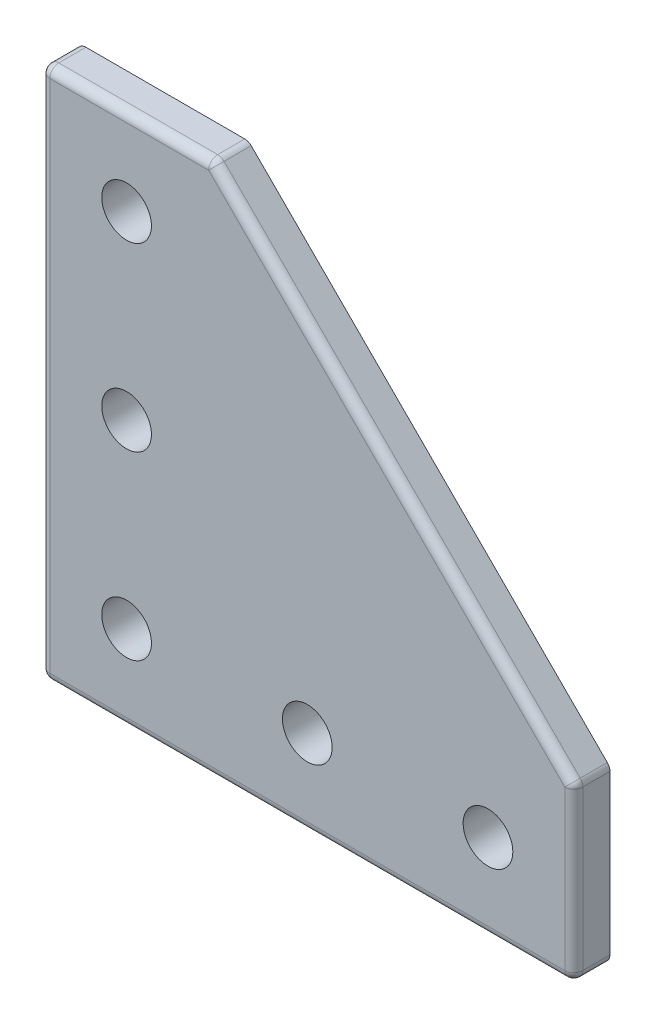
ISO-10303-21;
HEADER;
FILE_DESCRIPTION(('STEP AP214'),'2;1');
FILE_NAME('part.step','',(''),(''),'','','');
FILE_SCHEMA(('AUTOMOTIVE_DESIGN { 1 0 10303 214 1 1 1 1 }'));
ENDSEC;
DATA;
#1=APPLICATION_CONTEXT('core data for automotive mechanical design processes');
#2=APPLICATION_PROTOCOL_DEFINITION('international standard','automotive_design',2000,#1);
#3=PRODUCT_CONTEXT('',#1,'mechanical');
#4=PRODUCT('Part','Part','',(#3));
#5=PRODUCT_RELATED_PRODUCT_CATEGORY('part','',(#4));
#6=PRODUCT_DEFINITION_FORMATION('','',#4);
#7=PRODUCT_DEFINITION_CONTEXT('part definition',#1,'design');
#8=PRODUCT_DEFINITION('design','',#6,#7);
#9=PRODUCT_DEFINITION_SHAPE('','',#8);
#10=(LENGTH_UNIT() NAMED_UNIT(*) SI_UNIT(.MILLI.,.METRE.));
#11=(NAMED_UNIT(*) PLANE_ANGLE_UNIT() SI_UNIT($,.RADIAN.));
#12=(NAMED_UNIT(*) SI_UNIT($,.STERADIAN.) SOLID_ANGLE_UNIT());
#13=UNCERTAINTY_MEASURE_WITH_UNIT(LENGTH_MEASURE(1.E-05),#10,'distance_accuracy_value','');
#14=(GEOMETRIC_REPRESENTATION_CONTEXT(3) GLOBAL_UNCERTAINTY_ASSIGNED_CONTEXT((#13)) GLOBAL_UNIT_ASSIGNED_CONTEXT((#10,
#11,#12)) REPRESENTATION_CONTEXT('',''));
#15=CARTESIAN_POINT('',(0.,0.,0.));
#16=DIRECTION('',(0.,0.,1.));
#17=DIRECTION('',(1.,0.,0.));
#18=AXIS2_PLACEMENT_3D('',#15,#16,#17);
#19=CARTESIAN_POINT('',(0.,0.,2.));
#20=DIRECTION('',(0.,0.,-1.));
#21=DIRECTION('',(-1.,0.,0.));
#22=AXIS2_PLACEMENT_3D('',#19,#20,#21);
#23=PLANE('',#22);
#24=DIRECTION('',(0.,-1.,0.));
#25=VECTOR('',#24,1.);
#26=CARTESIAN_POINT('',(1.,0.,2.));
#27=LINE('',#26,#25);
#28=CARTESIAN_POINT('',(1.,58.,2.));
#29=VERTEX_POINT('',#28);
#30=CARTESIAN_POINT('',(1.,1.,2.));
#31=VERTEX_POINT('',#30);
#32=EDGE_CURVE('E1161',#29,#31,#27,.T.);
#33=ORIENTED_EDGE('',*,*,#32,.T.);
#34=DIRECTION('',(1.,0.,0.));
#35=VECTOR('',#34,1.);
#36=CARTESIAN_POINT('',(0.,1.,2.));
#37=LINE('',#36,#35);
#38=CARTESIAN_POINT('',(58.,0.999999999999998,2.));
#39=VERTEX_POINT('',#38);
#40=EDGE_CURVE('E1168',#31,#39,#37,.T.);
#41=ORIENTED_EDGE('',*,*,#40,.T.);
#42=DIRECTION('',(0.,1.,0.));
#43=VECTOR('',#42,1.);
#44=CARTESIAN_POINT('',(58.,0.,2.));
#45=LINE('',#44,#43);
#46=CARTESIAN_POINT('',(58.,18.5857864376269,2.));
#47=VERTEX_POINT('',#46);
#48=EDGE_CURVE('E1166',#39,#47,#45,.T.);
#49=ORIENTED_EDGE('',*,*,#48,.T.);
#50=DIRECTION('',(-0.707106781186547,0.707106781186548,0.));
#51=VECTOR('',#50,1.);
#52=CARTESIAN_POINT('',(38.2928932188135,38.2928932188134,2.));
#53=LINE('',#52,#51);
#54=CARTESIAN_POINT('',(18.5857864376269,58.,2.));
#55=VERTEX_POINT('',#54);
#56=EDGE_CURVE('E1163',#47,#55,#53,.T.);
#57=ORIENTED_EDGE('',*,*,#56,.T.);
#58=DIRECTION('',(-1.,0.,0.));
#59=VECTOR('',#58,1.);
#60=CARTESIAN_POINT('',(0.,58.,2.));
#61=LINE('',#60,#59);
#62=EDGE_CURVE('E1159',#55,#29,#61,.T.);
#63=ORIENTED_EDGE('',*,*,#62,.T.);
#64=EDGE_LOOP('',(#33,#41,#49,#57,#63));
#65=FACE_BOUND('',#64,.T.);
#66=CARTESIAN_POINT('',(9.5,29.5,2.));
#67=DIRECTION('',(0.,0.,1.));
#68=DIRECTION('',(1.,0.,0.));
#69=AXIS2_PLACEMENT_3D('',#66,#67,#68);
#70=CIRCLE('',#69,2.75000000000001);
#71=CARTESIAN_POINT('',(12.25,29.5,2.));
#72=VERTEX_POINT('',#71);
#73=EDGE_CURVE('E1238',#72,#72,#70,.T.);
#74=ORIENTED_EDGE('',*,*,#73,.F.);
#75=EDGE_LOOP('',(#74));
#76=FACE_BOUND('',#75,.T.);
#77=CARTESIAN_POINT('',(29.5,9.49999999999999,2.));
#78=DIRECTION('',(0.,0.,1.));
#79=DIRECTION('',(1.,0.,0.));
#80=AXIS2_PLACEMENT_3D('',#77,#78,#79);
#81=CIRCLE('',#80,2.75);
#82=CARTESIAN_POINT('',(32.25,9.49999999999999,2.));
#83=VERTEX_POINT('',#82);
#84=EDGE_CURVE('E1250',#83,#83,#81,.T.);
#85=ORIENTED_EDGE('',*,*,#84,.F.);
#86=EDGE_LOOP('',(#85));
#87=FACE_BOUND('',#86,.T.);
#88=CARTESIAN_POINT('',(9.5,9.49999999999999,2.));
#89=DIRECTION('',(0.,0.,1.));
#90=DIRECTION('',(1.,0.,0.));
#91=AXIS2_PLACEMENT_3D('',#88,#89,#90);
#92=CIRCLE('',#91,2.75);
#93=CARTESIAN_POINT('',(12.25,9.49999999999999,2.));
#94=VERTEX_POINT('',#93);
#95=EDGE_CURVE('E1256',#94,#94,#92,.T.);
#96=ORIENTED_EDGE('',*,*,#95,.F.);
#97=EDGE_LOOP('',(#96));
#98=FACE_BOUND('',#97,.T.);
#99=CARTESIAN_POINT('',(49.5,9.49999999999999,2.));
#100=DIRECTION('',(0.,0.,1.));
#101=DIRECTION('',(1.,0.,0.));
#102=AXIS2_PLACEMENT_3D('',#99,#100,#101);
#103=CIRCLE('',#102,2.75000000000001);
#104=CARTESIAN_POINT('',(52.25,9.49999999999999,2.));
#105=VERTEX_POINT('',#104);
#106=EDGE_CURVE('E1244',#105,#105,#103,.T.);
#107=ORIENTED_EDGE('',*,*,#106,.F.);
#108=EDGE_LOOP('',(#107));
#109=FACE_BOUND('',#108,.T.);
#110=CARTESIAN_POINT('',(9.5,49.5,2.));
#111=DIRECTION('',(0.,0.,1.));
#112=DIRECTION('',(1.,0.,0.));
#113=AXIS2_PLACEMENT_3D('',#110,#111,#112);
#114=CIRCLE('',#113,2.75);
#115=CARTESIAN_POINT('',(12.25,49.5,2.));
#116=VERTEX_POINT('',#115);
#117=EDGE_CURVE('E1230',#116,#116,#114,.T.);
#118=ORIENTED_EDGE('',*,*,#117,.F.);
#119=EDGE_LOOP('',(#118));
#120=FACE_BOUND('',#119,.T.);
#121=ADVANCED_FACE('F1018',(#65,#76,#87,#98,#109,#120),#23,.F.);
#122=CARTESIAN_POINT('',(0.,0.,-2.));
#123=DIRECTION('',(0.,0.,-1.));
#124=DIRECTION('',(-1.,0.,0.));
#125=AXIS2_PLACEMENT_3D('',#122,#123,#124);
#126=PLANE('',#125);
#127=CARTESIAN_POINT('',(9.5,29.5,-2.));
#128=DIRECTION('',(0.,0.,1.));
#129=DIRECTION('',(1.,0.,0.));
#130=AXIS2_PLACEMENT_3D('',#127,#128,#129);
#131=CIRCLE('',#130,2.75000000000001);
#132=CARTESIAN_POINT('',(12.25,29.5,-2.));
#133=VERTEX_POINT('',#132);
#134=EDGE_CURVE('E1235',#133,#133,#131,.T.);
#135=ORIENTED_EDGE('',*,*,#134,.T.);
#136=EDGE_LOOP('',(#135));
#137=FACE_BOUND('',#136,.T.);
#138=CARTESIAN_POINT('',(29.5,9.49999999999999,-2.));
#139=DIRECTION('',(0.,0.,1.));
#140=DIRECTION('',(1.,0.,0.));
#141=AXIS2_PLACEMENT_3D('',#138,#139,#140);
#142=CIRCLE('',#141,2.75);
#143=CARTESIAN_POINT('',(32.25,9.49999999999999,-2.));
#144=VERTEX_POINT('',#143);
#145=EDGE_CURVE('E1247',#144,#144,#142,.T.);
#146=ORIENTED_EDGE('',*,*,#145,.T.);
#147=EDGE_LOOP('',(#146));
#148=FACE_BOUND('',#147,.T.);
#149=DIRECTION('',(-0.707106781186547,0.707106781186548,0.));
#150=VECTOR('',#149,1.);
#151=CARTESIAN_POINT('',(19.,59.,-2.));
#152=LINE('',#151,#150);
#153=CARTESIAN_POINT('',(58.7071067811865,19.2928932188134,-2.));
#154=VERTEX_POINT('',#153);
#155=CARTESIAN_POINT('',(19.2928932188135,58.7071067811865,-2.));
#156=VERTEX_POINT('',#155);
#157=EDGE_CURVE('E1124',#154,#156,#152,.T.);
#158=ORIENTED_EDGE('',*,*,#157,.F.);
#159=CARTESIAN_POINT('',(58.,18.5857864376269,-2.));
#160=DIRECTION('',(0.,0.,-1.));
#161=DIRECTION('',(-1.,0.,0.));
#162=AXIS2_PLACEMENT_3D('',#159,#160,#161);
#163=CIRCLE('',#162,1.);
#164=CARTESIAN_POINT('',(59.,18.5857864376269,-2.));
#165=VERTEX_POINT('',#164);
#166=EDGE_CURVE('E1108',#154,#165,#163,.T.);
#167=ORIENTED_EDGE('',*,*,#166,.T.);
#168=DIRECTION('',(0.,1.,0.));
#169=VECTOR('',#168,1.);
#170=CARTESIAN_POINT('',(59.,19.,-2.));
#171=LINE('',#170,#169);
#172=CARTESIAN_POINT('',(59.,0.999999999999997,-2.));
#173=VERTEX_POINT('',#172);
#174=EDGE_CURVE('E1136',#173,#165,#171,.T.);
#175=ORIENTED_EDGE('',*,*,#174,.F.);
#176=CARTESIAN_POINT('',(58.,0.999999999999997,-2.));
#177=DIRECTION('',(0.,0.,-1.));
#178=DIRECTION('',(-1.,0.,0.));
#179=AXIS2_PLACEMENT_3D('',#176,#177,#178);
#180=CIRCLE('',#179,1.);
#181=CARTESIAN_POINT('',(58.,0.,-2.));
#182=VERTEX_POINT('',#181);
#183=EDGE_CURVE('E1150',#173,#182,#180,.T.);
#184=ORIENTED_EDGE('',*,*,#183,.T.);
#185=DIRECTION('',(1.,0.,0.));
#186=VECTOR('',#185,1.);
#187=CARTESIAN_POINT('',(59.,0.,-2.));
#188=LINE('',#187,#186);
#189=CARTESIAN_POINT('',(1.,0.,-2.));
#190=VERTEX_POINT('',#189);
#191=EDGE_CURVE('E1141',#190,#182,#188,.T.);
#192=ORIENTED_EDGE('',*,*,#191,.F.);
#193=CARTESIAN_POINT('',(1.,1.,-2.));
#194=DIRECTION('',(0.,0.,-1.));
#195=DIRECTION('',(-1.,0.,0.));
#196=AXIS2_PLACEMENT_3D('',#193,#194,#195);
#197=CIRCLE('',#196,1.);
#198=CARTESIAN_POINT('',(0.,1.,-2.));
#199=VERTEX_POINT('',#198);
#200=EDGE_CURVE('E1152',#190,#199,#197,.T.);
#201=ORIENTED_EDGE('',*,*,#200,.T.);
#202=DIRECTION('',(0.,-1.,0.));
#203=VECTOR('',#202,1.);
#204=CARTESIAN_POINT('',(0.,0.,-2.));
#205=LINE('',#204,#203);
#206=CARTESIAN_POINT('',(0.,58.,-2.));
#207=VERTEX_POINT('',#206);
#208=EDGE_CURVE('E1139',#207,#199,#205,.T.);
#209=ORIENTED_EDGE('',*,*,#208,.F.);
#210=CARTESIAN_POINT('',(1.,58.,-2.));
#211=DIRECTION('',(0.,0.,-1.));
#212=DIRECTION('',(-1.,0.,0.));
#213=AXIS2_PLACEMENT_3D('',#210,#211,#212);
#214=CIRCLE('',#213,1.);
#215=CARTESIAN_POINT('',(1.,59.,-2.));
#216=VERTEX_POINT('',#215);
#217=EDGE_CURVE('E1129',#207,#216,#214,.T.);
#218=ORIENTED_EDGE('',*,*,#217,.T.);
#219=DIRECTION('',(-1.,0.,0.));
#220=VECTOR('',#219,1.);
#221=CARTESIAN_POINT('',(19.,59.,-2.));
#222=LINE('',#221,#220);
#223=CARTESIAN_POINT('',(18.5857864376269,59.,-2.));
#224=VERTEX_POINT('',#223);
#225=EDGE_CURVE('E1135',#224,#216,#222,.T.);
#226=ORIENTED_EDGE('',*,*,#225,.F.);
#227=CARTESIAN_POINT('',(18.5857864376269,58.,-2.));
#228=DIRECTION('',(0.,0.,-1.));
#229=DIRECTION('',(-1.,0.,0.));
#230=AXIS2_PLACEMENT_3D('',#227,#228,#229);
#231=CIRCLE('',#230,1.);
#232=EDGE_CURVE('E1119',#224,#156,#231,.T.);
#233=ORIENTED_EDGE('',*,*,#232,.T.);
#234=EDGE_LOOP('',(#158,#167,#175,#184,#192,#201,#209,#218,#226,#233));
#235=FACE_BOUND('',#234,.T.);
#236=CARTESIAN_POINT('',(9.5,9.49999999999999,-2.));
#237=DIRECTION('',(0.,0.,1.));
#238=DIRECTION('',(1.,0.,0.));
#239=AXIS2_PLACEMENT_3D('',#236,#237,#238);
#240=CIRCLE('',#239,2.75);
#241=CARTESIAN_POINT('',(12.25,9.49999999999999,-2.));
#242=VERTEX_POINT('',#241);
#243=EDGE_CURVE('E1253',#242,#242,#240,.T.);
#244=ORIENTED_EDGE('',*,*,#243,.T.);
#245=EDGE_LOOP('',(#244));
#246=FACE_BOUND('',#245,.T.);
#247=CARTESIAN_POINT('',(49.5,9.49999999999999,-2.));
#248=DIRECTION('',(0.,0.,1.));
#249=DIRECTION('',(1.,0.,0.));
#250=AXIS2_PLACEMENT_3D('',#247,#248,#249);
#251=CIRCLE('',#250,2.75000000000001);
#252=CARTESIAN_POINT('',(52.25,9.49999999999999,-2.));
#253=VERTEX_POINT('',#252);
#254=EDGE_CURVE('E1241',#253,#253,#251,.T.);
#255=ORIENTED_EDGE('',*,*,#254,.T.);
#256=EDGE_LOOP('',(#255));
#257=FACE_BOUND('',#256,.T.);
#258=CARTESIAN_POINT('',(9.5,49.5,-2.));
#259=DIRECTION('',(0.,0.,1.));
#260=DIRECTION('',(1.,0.,0.));
#261=AXIS2_PLACEMENT_3D('',#258,#259,#260);
#262=CIRCLE('',#261,2.75);
#263=CARTESIAN_POINT('',(12.25,49.5,-2.));
#264=VERTEX_POINT('',#263);
#265=EDGE_CURVE('E1227',#264,#264,#262,.T.);
#266=ORIENTED_EDGE('',*,*,#265,.T.);
#267=EDGE_LOOP('',(#266));
#268=FACE_BOUND('',#267,.T.);
#269=ADVANCED_FACE('F1131',(#137,#148,#235,#246,#257,#268),#126,.T.);
#270=CARTESIAN_POINT('',(59.,0.,2.));
#271=DIRECTION('',(0.,1.,0.));
#272=DIRECTION('',(-1.,0.,0.));
#273=AXIS2_PLACEMENT_3D('',#270,#271,#272);
#274=PLANE('',#273);
#275=DIRECTION('',(1.,0.,0.));
#276=VECTOR('',#275,1.);
#277=CARTESIAN_POINT('',(59.,0.,1.));
#278=LINE('',#277,#276);
#279=CARTESIAN_POINT('',(58.,0.,1.));
#280=VERTEX_POINT('',#279);
#281=CARTESIAN_POINT('',(1.,0.,1.));
#282=VERTEX_POINT('',#281);
#283=EDGE_CURVE('E1178',#280,#282,#278,.F.);
#284=ORIENTED_EDGE('',*,*,#283,.T.);
#285=DIRECTION('',(0.,0.,-1.));
#286=VECTOR('',#285,1.);
#287=CARTESIAN_POINT('',(1.,0.,2.));
#288=LINE('',#287,#286);
#289=EDGE_CURVE('E1180',#282,#190,#288,.T.);
#290=ORIENTED_EDGE('',*,*,#289,.T.);
#291=ORIENTED_EDGE('',*,*,#191,.T.);
#292=DIRECTION('',(0.,0.,-1.));
#293=VECTOR('',#292,1.);
#294=CARTESIAN_POINT('',(58.,0.,2.));
#295=LINE('',#294,#293);
#296=EDGE_CURVE('E1176',#182,#280,#295,.F.);
#297=ORIENTED_EDGE('',*,*,#296,.T.);
#298=EDGE_LOOP('',(#284,#290,#291,#297));
#299=FACE_BOUND('',#298,.T.);
#300=ADVANCED_FACE('F1264',(#299),#274,.F.);
#301=CARTESIAN_POINT('',(59.,19.,2.));
#302=DIRECTION('',(-1.,0.,0.));
#303=DIRECTION('',(0.,0.,1.));
#304=AXIS2_PLACEMENT_3D('',#301,#302,#303);
#305=PLANE('',#304);
#306=ORIENTED_EDGE('',*,*,#174,.T.);
#307=DIRECTION('',(0.,0.,-1.));
#308=VECTOR('',#307,1.);
#309=CARTESIAN_POINT('',(59.,18.5857864376269,2.));
#310=LINE('',#309,#308);
#311=CARTESIAN_POINT('',(59.,18.5857864376269,1.));
#312=VERTEX_POINT('',#311);
#313=EDGE_CURVE('E1113',#165,#312,#310,.F.);
#314=ORIENTED_EDGE('',*,*,#313,.T.);
#315=DIRECTION('',(0.,1.,0.));
#316=VECTOR('',#315,1.);
#317=CARTESIAN_POINT('',(59.,19.,1.));
#318=LINE('',#317,#316);
#319=CARTESIAN_POINT('',(59.,0.999999999999997,1.));
#320=VERTEX_POINT('',#319);
#321=EDGE_CURVE('E1156',#312,#320,#318,.F.);
#322=ORIENTED_EDGE('',*,*,#321,.T.);
#323=DIRECTION('',(0.,0.,-1.));
#324=VECTOR('',#323,1.);
#325=CARTESIAN_POINT('',(59.,0.999999999999997,2.));
#326=LINE('',#325,#324);
#327=EDGE_CURVE('E1118',#320,#173,#326,.T.);
#328=ORIENTED_EDGE('',*,*,#327,.T.);
#329=EDGE_LOOP('',(#306,#314,#322,#328));
#330=FACE_BOUND('',#329,.T.);
#331=ADVANCED_FACE('F1321',(#330),#305,.F.);
#332=CARTESIAN_POINT('',(19.,59.,2.));
#333=DIRECTION('',(-0.707106781186548,-0.707106781186547,0.));
#334=DIRECTION('',(0.707106781186547,-0.707106781186548,0.));
#335=AXIS2_PLACEMENT_3D('',#332,#333,#334);
#336=PLANE('',#335);
#337=DIRECTION('',(-0.707106781186547,0.707106781186548,0.));
#338=VECTOR('',#337,1.);
#339=CARTESIAN_POINT('',(19.,59.,1.));
#340=LINE('',#339,#338);
#341=CARTESIAN_POINT('',(19.2928932188135,58.7071067811865,1.));
#342=VERTEX_POINT('',#341);
#343=CARTESIAN_POINT('',(58.7071067811865,19.2928932188134,1.));
#344=VERTEX_POINT('',#343);
#345=EDGE_CURVE('E1127',#342,#344,#340,.F.);
#346=ORIENTED_EDGE('',*,*,#345,.T.);
#347=DIRECTION('',(0.,0.,-1.));
#348=VECTOR('',#347,1.);
#349=CARTESIAN_POINT('',(58.7071067811865,19.2928932188134,2.));
#350=LINE('',#349,#348);
#351=EDGE_CURVE('E1112',#344,#154,#350,.T.);
#352=ORIENTED_EDGE('',*,*,#351,.T.);
#353=ORIENTED_EDGE('',*,*,#157,.T.);
#354=DIRECTION('',(0.,0.,-1.));
#355=VECTOR('',#354,1.);
#356=CARTESIAN_POINT('',(19.2928932188135,58.7071067811865,2.));
#357=LINE('',#356,#355);
#358=EDGE_CURVE('E1146',#156,#342,#357,.F.);
#359=ORIENTED_EDGE('',*,*,#358,.T.);
#360=EDGE_LOOP('',(#346,#352,#353,#359));
#361=FACE_BOUND('',#360,.T.);
#362=ADVANCED_FACE('F1123',(#361),#336,.F.);
#363=CARTESIAN_POINT('',(19.,59.,2.));
#364=DIRECTION('',(0.,-1.,0.));
#365=DIRECTION('',(0.,0.,-1.));
#366=AXIS2_PLACEMENT_3D('',#363,#364,#365);
#367=PLANE('',#366);
#368=DIRECTION('',(-1.,0.,0.));
#369=VECTOR('',#368,1.);
#370=CARTESIAN_POINT('',(19.,59.,1.));
#371=LINE('',#370,#369);
#372=CARTESIAN_POINT('',(1.,59.,1.));
#373=VERTEX_POINT('',#372);
#374=CARTESIAN_POINT('',(18.5857864376269,59.,1.));
#375=VERTEX_POINT('',#374);
#376=EDGE_CURVE('E1172',#373,#375,#371,.F.);
#377=ORIENTED_EDGE('',*,*,#376,.T.);
#378=DIRECTION('',(0.,0.,-1.));
#379=VECTOR('',#378,1.);
#380=CARTESIAN_POINT('',(18.5857864376269,59.,2.));
#381=LINE('',#380,#379);
#382=EDGE_CURVE('E1174',#375,#224,#381,.T.);
#383=ORIENTED_EDGE('',*,*,#382,.T.);
#384=ORIENTED_EDGE('',*,*,#225,.T.);
#385=DIRECTION('',(0.,0.,-1.));
#386=VECTOR('',#385,1.);
#387=CARTESIAN_POINT('',(1.,59.,2.));
#388=LINE('',#387,#386);
#389=EDGE_CURVE('E1170',#216,#373,#388,.F.);
#390=ORIENTED_EDGE('',*,*,#389,.T.);
#391=EDGE_LOOP('',(#377,#383,#384,#390));
#392=FACE_BOUND('',#391,.T.);
#393=ADVANCED_FACE('F1303',(#392),#367,.F.);
#394=CARTESIAN_POINT('',(0.,0.,2.));
#395=DIRECTION('',(1.,0.,0.));
#396=DIRECTION('',(0.,0.,-1.));
#397=AXIS2_PLACEMENT_3D('',#394,#395,#396);
#398=PLANE('',#397);
#399=ORIENTED_EDGE('',*,*,#208,.T.);
#400=DIRECTION('',(0.,0.,-1.));
#401=VECTOR('',#400,1.);
#402=CARTESIAN_POINT('',(0.,1.,2.));
#403=LINE('',#402,#401);
#404=CARTESIAN_POINT('',(0.,1.,1.));
#405=VERTEX_POINT('',#404);
#406=EDGE_CURVE('E12',#199,#405,#403,.F.);
#407=ORIENTED_EDGE('',*,*,#406,.T.);
#408=DIRECTION('',(0.,-1.,0.));
#409=VECTOR('',#408,1.);
#410=CARTESIAN_POINT('',(0.,0.,1.));
#411=LINE('',#410,#409);
#412=CARTESIAN_POINT('',(0.,58.,1.));
#413=VERTEX_POINT('',#412);
#414=EDGE_CURVE('E1027',#405,#413,#411,.F.);
#415=ORIENTED_EDGE('',*,*,#414,.T.);
#416=DIRECTION('',(0.,0.,-1.));
#417=VECTOR('',#416,1.);
#418=CARTESIAN_POINT('',(0.,58.,2.));
#419=LINE('',#418,#417);
#420=EDGE_CURVE('E1182',#413,#207,#419,.T.);
#421=ORIENTED_EDGE('',*,*,#420,.T.);
#422=EDGE_LOOP('',(#399,#407,#415,#421));
#423=FACE_BOUND('',#422,.T.);
#424=ADVANCED_FACE('F1284',(#423),#398,.F.);
#425=CARTESIAN_POINT('',(9.5,9.49999999999999,2.));
#426=DIRECTION('',(0.,0.,-1.));
#427=DIRECTION('',(-1.,0.,0.));
#428=AXIS2_PLACEMENT_3D('',#425,#426,#427);
#429=CYLINDRICAL_SURFACE('',#428,2.75);
#430=ORIENTED_EDGE('',*,*,#95,.T.);
#431=EDGE_LOOP('',(#430));
#432=FACE_BOUND('',#431,.T.);
#433=ORIENTED_EDGE('',*,*,#243,.F.);
#434=EDGE_LOOP('',(#433));
#435=FACE_BOUND('',#434,.T.);
#436=ADVANCED_FACE('F1340',(#432,#435),#429,.F.);
#437=CARTESIAN_POINT('',(29.5,9.49999999999999,2.));
#438=DIRECTION('',(0.,0.,-1.));
#439=DIRECTION('',(-1.,0.,0.));
#440=AXIS2_PLACEMENT_3D('',#437,#438,#439);
#441=CYLINDRICAL_SURFACE('',#440,2.75);
#442=ORIENTED_EDGE('',*,*,#84,.T.);
#443=EDGE_LOOP('',(#442));
#444=FACE_BOUND('',#443,.T.);
#445=ORIENTED_EDGE('',*,*,#145,.F.);
#446=EDGE_LOOP('',(#445));
#447=FACE_BOUND('',#446,.T.);
#448=ADVANCED_FACE('F1361',(#444,#447),#441,.F.);
#449=CARTESIAN_POINT('',(49.5,9.49999999999999,2.));
#450=DIRECTION('',(0.,0.,-1.));
#451=DIRECTION('',(-1.,0.,0.));
#452=AXIS2_PLACEMENT_3D('',#449,#450,#451);
#453=CYLINDRICAL_SURFACE('',#452,2.75000000000001);
#454=ORIENTED_EDGE('',*,*,#106,.T.);
#455=EDGE_LOOP('',(#454));
#456=FACE_BOUND('',#455,.T.);
#457=ORIENTED_EDGE('',*,*,#254,.F.);
#458=EDGE_LOOP('',(#457));
#459=FACE_BOUND('',#458,.T.);
#460=ADVANCED_FACE('F1368',(#456,#459),#453,.F.);
#461=CARTESIAN_POINT('',(9.5,29.5,2.));
#462=DIRECTION('',(0.,0.,-1.));
#463=DIRECTION('',(-1.,0.,0.));
#464=AXIS2_PLACEMENT_3D('',#461,#462,#463);
#465=CYLINDRICAL_SURFACE('',#464,2.75000000000001);
#466=ORIENTED_EDGE('',*,*,#73,.T.);
#467=EDGE_LOOP('',(#466));
#468=FACE_BOUND('',#467,.T.);
#469=ORIENTED_EDGE('',*,*,#134,.F.);
#470=EDGE_LOOP('',(#469));
#471=FACE_BOUND('',#470,.T.);
#472=ADVANCED_FACE('F1375',(#468,#471),#465,.F.);
#473=CARTESIAN_POINT('',(9.5,49.5,2.));
#474=DIRECTION('',(0.,0.,-1.));
#475=DIRECTION('',(-1.,0.,0.));
#476=AXIS2_PLACEMENT_3D('',#473,#474,#475);
#477=CYLINDRICAL_SURFACE('',#476,2.75);
#478=ORIENTED_EDGE('',*,*,#117,.T.);
#479=EDGE_LOOP('',(#478));
#480=FACE_BOUND('',#479,.T.);
#481=ORIENTED_EDGE('',*,*,#265,.F.);
#482=EDGE_LOOP('',(#481));
#483=FACE_BOUND('',#482,.T.);
#484=ADVANCED_FACE('F1383',(#480,#483),#477,.F.);
#485=CARTESIAN_POINT('',(1.,1.,2.));
#486=DIRECTION('',(0.,0.,-1.));
#487=DIRECTION('',(-1.,0.,0.));
#488=AXIS2_PLACEMENT_3D('',#485,#486,#487);
#489=CYLINDRICAL_SURFACE('',#488,1.);
#490=ORIENTED_EDGE('',*,*,#200,.F.);
#491=ORIENTED_EDGE('',*,*,#289,.F.);
#492=CARTESIAN_POINT('',(1.,1.,1.));
#493=DIRECTION('',(0.,0.,1.));
#494=DIRECTION('',(1.,0.,0.));
#495=AXIS2_PLACEMENT_3D('',#492,#493,#494);
#496=CIRCLE('',#495,1.);
#497=EDGE_CURVE('E1022',#405,#282,#496,.T.);
#498=ORIENTED_EDGE('',*,*,#497,.F.);
#499=ORIENTED_EDGE('',*,*,#406,.F.);
#500=EDGE_LOOP('',(#490,#491,#498,#499));
#501=FACE_BOUND('',#500,.T.);
#502=ADVANCED_FACE('F1020',(#501),#489,.T.);
#503=CARTESIAN_POINT('',(1.,0.,1.));
#504=DIRECTION('',(0.,-1.,0.));
#505=DIRECTION('',(0.,0.,-1.));
#506=AXIS2_PLACEMENT_3D('',#503,#504,#505);
#507=CYLINDRICAL_SURFACE('',#506,1.);
#508=CARTESIAN_POINT('',(1.,58.,1.));
#509=DIRECTION('',(0.,1.,0.));
#510=DIRECTION('',(0.,0.,1.));
#511=AXIS2_PLACEMENT_3D('',#508,#509,#510);
#512=CIRCLE('',#511,1.);
#513=EDGE_CURVE('E1219',#413,#29,#512,.T.);
#514=ORIENTED_EDGE('',*,*,#513,.F.);
#515=ORIENTED_EDGE('',*,*,#414,.F.);
#516=CARTESIAN_POINT('',(1.,1.,1.));
#517=DIRECTION('',(0.,-1.,0.));
#518=DIRECTION('',(0.,0.,-1.));
#519=AXIS2_PLACEMENT_3D('',#516,#517,#518);
#520=CIRCLE('',#519,1.);
#521=EDGE_CURVE('E1221',#31,#405,#520,.T.);
#522=ORIENTED_EDGE('',*,*,#521,.F.);
#523=ORIENTED_EDGE('',*,*,#32,.F.);
#524=EDGE_LOOP('',(#514,#515,#522,#523));
#525=FACE_BOUND('',#524,.T.);
#526=ADVANCED_FACE('F1293',(#525),#507,.T.);
#527=CARTESIAN_POINT('',(1.,58.,2.));
#528=DIRECTION('',(0.,0.,-1.));
#529=DIRECTION('',(-1.,0.,0.));
#530=AXIS2_PLACEMENT_3D('',#527,#528,#529);
#531=CYLINDRICAL_SURFACE('',#530,1.);
#532=ORIENTED_EDGE('',*,*,#217,.F.);
#533=ORIENTED_EDGE('',*,*,#420,.F.);
#534=CARTESIAN_POINT('',(1.,58.,1.));
#535=DIRECTION('',(0.,0.,1.));
#536=DIRECTION('',(1.,0.,0.));
#537=AXIS2_PLACEMENT_3D('',#534,#535,#536);
#538=CIRCLE('',#537,1.);
#539=EDGE_CURVE('E1216',#373,#413,#538,.T.);
#540=ORIENTED_EDGE('',*,*,#539,.F.);
#541=ORIENTED_EDGE('',*,*,#389,.F.);
#542=EDGE_LOOP('',(#532,#533,#540,#541));
#543=FACE_BOUND('',#542,.T.);
#544=ADVANCED_FACE('F1288',(#543),#531,.T.);
#545=CARTESIAN_POINT('',(1.,1.,1.));
#546=DIRECTION('',(0.,0.,1.));
#547=DIRECTION('',(1.,0.,0.));
#548=AXIS2_PLACEMENT_3D('',#545,#546,#547);
#549=SPHERICAL_SURFACE('',#548,1.);
#550=ORIENTED_EDGE('',*,*,#521,.T.);
#551=ORIENTED_EDGE('',*,*,#497,.T.);
#552=CARTESIAN_POINT('',(1.,1.,1.));
#553=DIRECTION('',(-1.,0.,0.));
#554=DIRECTION('',(0.,0.,1.));
#555=AXIS2_PLACEMENT_3D('',#552,#553,#554);
#556=CIRCLE('',#555,1.);
#557=EDGE_CURVE('E1213',#31,#282,#556,.F.);
#558=ORIENTED_EDGE('',*,*,#557,.F.);
#559=EDGE_LOOP('',(#550,#551,#558));
#560=FACE_BOUND('',#559,.T.);
#561=ADVANCED_FACE('F1407',(#560),#549,.T.);
#562=CARTESIAN_POINT('',(1.,58.,1.));
#563=DIRECTION('',(0.,0.,1.));
#564=DIRECTION('',(1.,0.,0.));
#565=AXIS2_PLACEMENT_3D('',#562,#563,#564);
#566=SPHERICAL_SURFACE('',#565,1.);
#567=ORIENTED_EDGE('',*,*,#539,.T.);
#568=ORIENTED_EDGE('',*,*,#513,.T.);
#569=CARTESIAN_POINT('',(1.,58.,1.));
#570=DIRECTION('',(-1.,0.,0.));
#571=DIRECTION('',(0.,0.,1.));
#572=AXIS2_PLACEMENT_3D('',#569,#570,#571);
#573=CIRCLE('',#572,1.);
#574=EDGE_CURVE('E1210',#373,#29,#573,.F.);
#575=ORIENTED_EDGE('',*,*,#574,.F.);
#576=EDGE_LOOP('',(#567,#568,#575));
#577=FACE_BOUND('',#576,.T.);
#578=ADVANCED_FACE('F1295',(#577),#566,.T.);
#579=CARTESIAN_POINT('',(58.,0.999999999999997,2.));
#580=DIRECTION('',(0.,0.,-1.));
#581=DIRECTION('',(-1.,0.,0.));
#582=AXIS2_PLACEMENT_3D('',#579,#580,#581);
#583=CYLINDRICAL_SURFACE('',#582,1.);
#584=ORIENTED_EDGE('',*,*,#183,.F.);
#585=ORIENTED_EDGE('',*,*,#327,.F.);
#586=CARTESIAN_POINT('',(58.,0.999999999999998,1.));
#587=DIRECTION('',(0.,0.,1.));
#588=DIRECTION('',(1.,0.,0.));
#589=AXIS2_PLACEMENT_3D('',#586,#587,#588);
#590=CIRCLE('',#589,1.);
#591=EDGE_CURVE('E1207',#280,#320,#590,.T.);
#592=ORIENTED_EDGE('',*,*,#591,.F.);
#593=ORIENTED_EDGE('',*,*,#296,.F.);
#594=EDGE_LOOP('',(#584,#585,#592,#593));
#595=FACE_BOUND('',#594,.T.);
#596=ADVANCED_FACE('F1271',(#595),#583,.T.);
#597=CARTESIAN_POINT('',(0.,1.,1.));
#598=DIRECTION('',(1.,0.,0.));
#599=DIRECTION('',(0.,1.,0.));
#600=AXIS2_PLACEMENT_3D('',#597,#598,#599);
#601=CYLINDRICAL_SURFACE('',#600,1.);
#602=ORIENTED_EDGE('',*,*,#557,.T.);
#603=ORIENTED_EDGE('',*,*,#283,.F.);
#604=CARTESIAN_POINT('',(58.,0.999999999999998,1.));
#605=DIRECTION('',(1.,0.,0.));
#606=DIRECTION('',(0.,0.,-1.));
#607=AXIS2_PLACEMENT_3D('',#604,#605,#606);
#608=CIRCLE('',#607,1.);
#609=EDGE_CURVE('E1204',#39,#280,#608,.T.);
#610=ORIENTED_EDGE('',*,*,#609,.F.);
#611=ORIENTED_EDGE('',*,*,#40,.F.);
#612=EDGE_LOOP('',(#602,#603,#610,#611));
#613=FACE_BOUND('',#612,.T.);
#614=ADVANCED_FACE('F1280',(#613),#601,.T.);
#615=CARTESIAN_POINT('',(0.,58.,1.));
#616=DIRECTION('',(-1.,0.,0.));
#617=DIRECTION('',(0.,0.,1.));
#618=AXIS2_PLACEMENT_3D('',#615,#616,#617);
#619=CYLINDRICAL_SURFACE('',#618,1.);
#620=ORIENTED_EDGE('',*,*,#574,.T.);
#621=ORIENTED_EDGE('',*,*,#62,.F.);
#622=CARTESIAN_POINT('',(18.5857864376269,58.,1.));
#623=DIRECTION('',(1.,0.,0.));
#624=DIRECTION('',(0.,0.,-1.));
#625=AXIS2_PLACEMENT_3D('',#622,#623,#624);
#626=CIRCLE('',#625,1.);
#627=EDGE_CURVE('E1201',#375,#55,#626,.T.);
#628=ORIENTED_EDGE('',*,*,#627,.F.);
#629=ORIENTED_EDGE('',*,*,#376,.F.);
#630=EDGE_LOOP('',(#620,#621,#628,#629));
#631=FACE_BOUND('',#630,.T.);
#632=ADVANCED_FACE('F1300',(#631),#619,.T.);
#633=CARTESIAN_POINT('',(18.5857864376269,58.,2.));
#634=DIRECTION('',(0.,0.,-1.));
#635=DIRECTION('',(-1.,0.,0.));
#636=AXIS2_PLACEMENT_3D('',#633,#634,#635);
#637=CYLINDRICAL_SURFACE('',#636,1.);
#638=ORIENTED_EDGE('',*,*,#232,.F.);
#639=ORIENTED_EDGE('',*,*,#382,.F.);
#640=CARTESIAN_POINT('',(18.5857864376269,58.,1.));
#641=DIRECTION('',(0.,0.,1.));
#642=DIRECTION('',(1.,0.,0.));
#643=AXIS2_PLACEMENT_3D('',#640,#641,#642);
#644=CIRCLE('',#643,1.);
#645=EDGE_CURVE('E1198',#342,#375,#644,.T.);
#646=ORIENTED_EDGE('',*,*,#645,.F.);
#647=ORIENTED_EDGE('',*,*,#358,.F.);
#648=EDGE_LOOP('',(#638,#639,#646,#647));
#649=FACE_BOUND('',#648,.T.);
#650=ADVANCED_FACE('F1306',(#649),#637,.T.);
#651=CARTESIAN_POINT('',(58.,0.999999999999998,1.));
#652=DIRECTION('',(0.,0.,1.));
#653=DIRECTION('',(1.,0.,0.));
#654=AXIS2_PLACEMENT_3D('',#651,#652,#653);
#655=SPHERICAL_SURFACE('',#654,1.);
#656=ORIENTED_EDGE('',*,*,#609,.T.);
#657=ORIENTED_EDGE('',*,*,#591,.T.);
#658=CARTESIAN_POINT('',(58.,0.999999999999997,1.));
#659=DIRECTION('',(0.,-1.,0.));
#660=DIRECTION('',(0.,0.,-1.));
#661=AXIS2_PLACEMENT_3D('',#658,#659,#660);
#662=CIRCLE('',#661,1.);
#663=EDGE_CURVE('E1195',#39,#320,#662,.F.);
#664=ORIENTED_EDGE('',*,*,#663,.F.);
#665=EDGE_LOOP('',(#656,#657,#664));
#666=FACE_BOUND('',#665,.T.);
#667=ADVANCED_FACE('F1276',(#666),#655,.T.);
#668=CARTESIAN_POINT('',(18.5857864376269,58.,1.));
#669=DIRECTION('',(0.,0.,1.));
#670=DIRECTION('',(1.,0.,0.));
#671=AXIS2_PLACEMENT_3D('',#668,#669,#670);
#672=SPHERICAL_SURFACE('',#671,1.);
#673=ORIENTED_EDGE('',*,*,#645,.T.);
#674=ORIENTED_EDGE('',*,*,#627,.T.);
#675=CARTESIAN_POINT('',(18.5857864376269,58.,1.));
#676=DIRECTION('',(-0.707106781186553,0.707106781186542,0.));
#677=DIRECTION('',(-0.707106781186542,-0.707106781186553,0.));
#678=AXIS2_PLACEMENT_3D('',#675,#676,#677);
#679=CIRCLE('',#678,1.);
#680=EDGE_CURVE('E1193',#342,#55,#679,.F.);
#681=ORIENTED_EDGE('',*,*,#680,.F.);
#682=EDGE_LOOP('',(#673,#674,#681));
#683=FACE_BOUND('',#682,.T.);
#684=ADVANCED_FACE('F1309',(#683),#672,.T.);
#685=CARTESIAN_POINT('',(58.,0.,1.));
#686=DIRECTION('',(0.,1.,0.));
#687=DIRECTION('',(0.,0.,1.));
#688=AXIS2_PLACEMENT_3D('',#685,#686,#687);
#689=CYLINDRICAL_SURFACE('',#688,1.);
#690=ORIENTED_EDGE('',*,*,#663,.T.);
#691=ORIENTED_EDGE('',*,*,#321,.F.);
#692=CARTESIAN_POINT('',(58.,18.5857864376269,1.));
#693=DIRECTION('',(0.,1.,0.));
#694=DIRECTION('',(-1.,0.,0.));
#695=AXIS2_PLACEMENT_3D('',#692,#693,#694);
#696=CIRCLE('',#695,1.);
#697=EDGE_CURVE('E1190',#47,#312,#696,.T.);
#698=ORIENTED_EDGE('',*,*,#697,.F.);
#699=ORIENTED_EDGE('',*,*,#48,.F.);
#700=EDGE_LOOP('',(#690,#691,#698,#699));
#701=FACE_BOUND('',#700,.T.);
#702=ADVANCED_FACE('F1319',(#701),#689,.T.);
#703=CARTESIAN_POINT('',(38.2928932188135,38.2928932188134,1.));
#704=DIRECTION('',(-0.707106781186547,0.707106781186548,0.));
#705=DIRECTION('',(-0.707106781186548,-0.707106781186547,0.));
#706=AXIS2_PLACEMENT_3D('',#703,#704,#705);
#707=CYLINDRICAL_SURFACE('',#706,1.);
#708=ORIENTED_EDGE('',*,*,#680,.T.);
#709=ORIENTED_EDGE('',*,*,#56,.F.);
#710=CARTESIAN_POINT('',(58.,18.5857864376269,1.));
#711=DIRECTION('',(0.707106781186549,-0.707106781186546,0.));
#712=DIRECTION('',(0.707106781186546,0.707106781186549,0.));
#713=AXIS2_PLACEMENT_3D('',#710,#711,#712);
#714=CIRCLE('',#713,1.);
#715=EDGE_CURVE('E1187',#344,#47,#714,.T.);
#716=ORIENTED_EDGE('',*,*,#715,.F.);
#717=ORIENTED_EDGE('',*,*,#345,.F.);
#718=EDGE_LOOP('',(#708,#709,#716,#717));
#719=FACE_BOUND('',#718,.T.);
#720=ADVANCED_FACE('F1312',(#719),#707,.T.);
#721=CARTESIAN_POINT('',(58.,18.5857864376269,1.));
#722=DIRECTION('',(0.,0.,1.));
#723=DIRECTION('',(1.,0.,0.));
#724=AXIS2_PLACEMENT_3D('',#721,#722,#723);
#725=SPHERICAL_SURFACE('',#724,1.);
#726=ORIENTED_EDGE('',*,*,#715,.T.);
#727=ORIENTED_EDGE('',*,*,#697,.T.);
#728=CARTESIAN_POINT('',(58.,18.5857864376269,1.));
#729=DIRECTION('',(0.,0.,1.));
#730=DIRECTION('',(1.,0.,0.));
#731=AXIS2_PLACEMENT_3D('',#728,#729,#730);
#732=CIRCLE('',#731,1.);
#733=EDGE_CURVE('E1185',#344,#312,#732,.F.);
#734=ORIENTED_EDGE('',*,*,#733,.F.);
#735=EDGE_LOOP('',(#726,#727,#734));
#736=FACE_BOUND('',#735,.T.);
#737=ADVANCED_FACE('F1316',(#736),#725,.T.);
#738=CARTESIAN_POINT('',(58.,18.5857864376269,2.));
#739=DIRECTION('',(0.,0.,-1.));
#740=DIRECTION('',(-1.,0.,0.));
#741=AXIS2_PLACEMENT_3D('',#738,#739,#740);
#742=CYLINDRICAL_SURFACE('',#741,1.);
#743=ORIENTED_EDGE('',*,*,#733,.T.);
#744=ORIENTED_EDGE('',*,*,#313,.F.);
#745=ORIENTED_EDGE('',*,*,#166,.F.);
#746=ORIENTED_EDGE('',*,*,#351,.F.);
#747=EDGE_LOOP('',(#743,#744,#745,#746));
#748=FACE_BOUND('',#747,.T.);
#749=ADVANCED_FACE('F1111',(#748),#742,.T.);
#750=CLOSED_SHELL('',(#121,#269,#300,#331,#362,#393,#424,#436,#448,#460,#472,#484,#502,#526,
#544,#561,#578,#596,#614,#632,#650,#667,#684,#702,#720,#737,#749));
#751=MANIFOLD_SOLID_BREP('B2',#750);
#752=ADVANCED_BREP_SHAPE_REPRESENTATION('',(#18,#751),#14);
#753=SHAPE_DEFINITION_REPRESENTATION(#9,#752);
ENDSEC;
END-ISO-10303-21;
